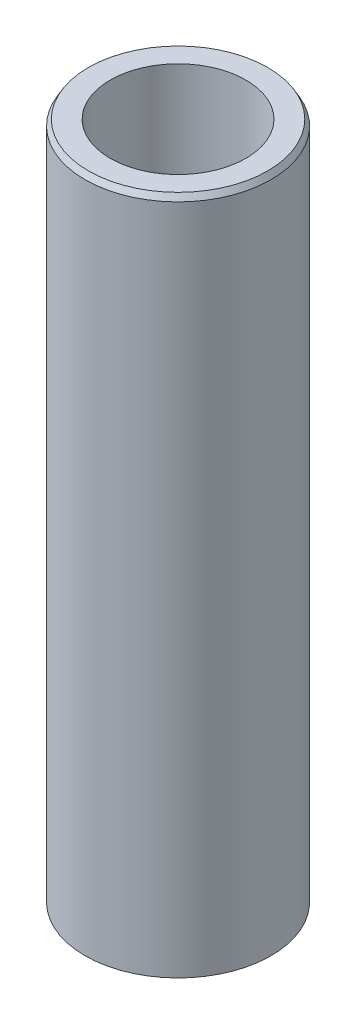
ISO-10303-21;
HEADER;
FILE_DESCRIPTION(('STEP AP214'),'2;1');
FILE_NAME('part.step','',(''),(''),'','','');
FILE_SCHEMA(('AUTOMOTIVE_DESIGN { 1 0 10303 214 1 1 1 1 }'));
ENDSEC;
DATA;
#1=APPLICATION_CONTEXT('core data for automotive mechanical design processes');
#2=APPLICATION_PROTOCOL_DEFINITION('international standard','automotive_design',2000,#1);
#3=PRODUCT_CONTEXT('',#1,'mechanical');
#4=PRODUCT('Part','Part','',(#3));
#5=PRODUCT_RELATED_PRODUCT_CATEGORY('part','',(#4));
#6=PRODUCT_DEFINITION_FORMATION('','',#4);
#7=PRODUCT_DEFINITION_CONTEXT('part definition',#1,'design');
#8=PRODUCT_DEFINITION('design','',#6,#7);
#9=PRODUCT_DEFINITION_SHAPE('','',#8);
#10=(LENGTH_UNIT() NAMED_UNIT(*) SI_UNIT(.MILLI.,.METRE.));
#11=(NAMED_UNIT(*) PLANE_ANGLE_UNIT() SI_UNIT($,.RADIAN.));
#12=(NAMED_UNIT(*) SI_UNIT($,.STERADIAN.) SOLID_ANGLE_UNIT());
#13=UNCERTAINTY_MEASURE_WITH_UNIT(LENGTH_MEASURE(1.E-05),#10,'distance_accuracy_value','');
#14=(GEOMETRIC_REPRESENTATION_CONTEXT(3) GLOBAL_UNCERTAINTY_ASSIGNED_CONTEXT((#13)) GLOBAL_UNIT_ASSIGNED_CONTEXT((#10,
#11,#12)) REPRESENTATION_CONTEXT('',''));
#15=CARTESIAN_POINT('',(0.,0.,0.));
#16=DIRECTION('',(0.,0.,1.));
#17=DIRECTION('',(1.,0.,0.));
#18=AXIS2_PLACEMENT_3D('',#15,#16,#17);
#19=CARTESIAN_POINT('',(0.,91.5575811647103,0.));
#20=DIRECTION('',(0.,-1.,0.));
#21=DIRECTION('',(0.,0.,-1.));
#22=AXIS2_PLACEMENT_3D('',#19,#20,#21);
#23=CYLINDRICAL_SURFACE('',#22,12.5);
#24=CARTESIAN_POINT('',(0.,90.7667106178552,0.));
#25=DIRECTION('',(0.,1.,0.));
#26=DIRECTION('',(0.,0.,1.));
#27=AXIS2_PLACEMENT_3D('',#24,#25,#26);
#28=CIRCLE('',#27,12.5);
#29=CARTESIAN_POINT('',(0.,90.7667106178552,12.5));
#30=VERTEX_POINT('',#29);
#31=EDGE_CURVE('E50',#30,#30,#28,.F.);
#32=ORIENTED_EDGE('',*,*,#31,.T.);
#33=EDGE_LOOP('',(#32));
#34=FACE_BOUND('',#33,.T.);
#35=CARTESIAN_POINT('',(0.,0.456609323120943,0.));
#36=DIRECTION('',(0.,1.,0.));
#37=DIRECTION('',(0.,0.,1.));
#38=AXIS2_PLACEMENT_3D('',#35,#36,#37);
#39=CIRCLE('',#38,12.5);
#40=CARTESIAN_POINT('',(0.,0.456609323120943,12.5));
#41=VERTEX_POINT('',#40);
#42=EDGE_CURVE('E51',#41,#41,#39,.T.);
#43=ORIENTED_EDGE('',*,*,#42,.T.);
#44=EDGE_LOOP('',(#43));
#45=FACE_BOUND('',#44,.T.);
#46=ADVANCED_FACE('F39',(#34,#45),#23,.T.);
#47=CARTESIAN_POINT('',(0.,91.5575811647103,0.));
#48=DIRECTION('',(0.,1.,0.));
#49=DIRECTION('',(0.,0.,1.));
#50=AXIS2_PLACEMENT_3D('',#47,#48,#49);
#51=PLANE('',#50);
#52=CARTESIAN_POINT('',(0.,91.5575811647103,0.));
#53=DIRECTION('',(0.,1.,0.));
#54=DIRECTION('',(0.,0.,1.));
#55=AXIS2_PLACEMENT_3D('',#52,#53,#54);
#56=CIRCLE('',#55,12.0433906768791);
#57=CARTESIAN_POINT('',(0.,91.5575811647103,12.0433906768791));
#58=VERTEX_POINT('',#57);
#59=EDGE_CURVE('E54',#58,#58,#56,.T.);
#60=ORIENTED_EDGE('',*,*,#59,.T.);
#61=EDGE_LOOP('',(#60));
#62=FACE_BOUND('',#61,.T.);
#63=CARTESIAN_POINT('',(0.,91.5575811647103,0.));
#64=DIRECTION('',(0.,1.,0.));
#65=DIRECTION('',(0.,0.,1.));
#66=AXIS2_PLACEMENT_3D('',#63,#64,#65);
#67=CIRCLE('',#66,9.11981826204988);
#68=CARTESIAN_POINT('',(0.,91.5575811647103,9.11981826204988));
#69=VERTEX_POINT('',#68);
#70=EDGE_CURVE('E58',#69,#69,#67,.T.);
#71=ORIENTED_EDGE('',*,*,#70,.F.);
#72=EDGE_LOOP('',(#71));
#73=FACE_BOUND('',#72,.T.);
#74=ADVANCED_FACE('F69',(#62,#73),#51,.T.);
#75=CARTESIAN_POINT('',(0.,0.,0.));
#76=DIRECTION('',(0.,1.,0.));
#77=DIRECTION('',(0.,0.,1.));
#78=AXIS2_PLACEMENT_3D('',#75,#76,#77);
#79=PLANE('',#78);
#80=CARTESIAN_POINT('',(0.,0.,0.));
#81=DIRECTION('',(0.,1.,0.));
#82=DIRECTION('',(0.,0.,1.));
#83=AXIS2_PLACEMENT_3D('',#80,#81,#82);
#84=CIRCLE('',#83,11.7091294531449);
#85=CARTESIAN_POINT('',(0.,0.,11.7091294531449));
#86=VERTEX_POINT('',#85);
#87=EDGE_CURVE('E10',#86,#86,#84,.F.);
#88=ORIENTED_EDGE('',*,*,#87,.T.);
#89=EDGE_LOOP('',(#88));
#90=FACE_BOUND('',#89,.T.);
#91=CARTESIAN_POINT('',(0.,0.,0.));
#92=DIRECTION('',(0.,1.,0.));
#93=DIRECTION('',(0.,0.,1.));
#94=AXIS2_PLACEMENT_3D('',#91,#92,#93);
#95=CIRCLE('',#94,9.11981826204988);
#96=CARTESIAN_POINT('',(0.,0.,9.11981826204988));
#97=VERTEX_POINT('',#96);
#98=EDGE_CURVE('E63',#97,#97,#95,.T.);
#99=ORIENTED_EDGE('',*,*,#98,.T.);
#100=EDGE_LOOP('',(#99));
#101=FACE_BOUND('',#100,.T.);
#102=ADVANCED_FACE('F75',(#90,#101),#79,.F.);
#103=CARTESIAN_POINT('',(0.,91.5575811647103,0.));
#104=DIRECTION('',(0.,-1.,0.));
#105=DIRECTION('',(0.,0.,-1.));
#106=AXIS2_PLACEMENT_3D('',#103,#104,#105);
#107=CYLINDRICAL_SURFACE('',#106,9.11981826204988);
#108=ORIENTED_EDGE('',*,*,#70,.T.);
#109=EDGE_LOOP('',(#108));
#110=FACE_BOUND('',#109,.T.);
#111=ORIENTED_EDGE('',*,*,#98,.F.);
#112=EDGE_LOOP('',(#111));
#113=FACE_BOUND('',#112,.T.);
#114=ADVANCED_FACE('F70',(#110,#113),#107,.F.);
#115=CARTESIAN_POINT('',(0.,91.5575811647103,0.));
#116=DIRECTION('',(0.,-1.,0.));
#117=DIRECTION('',(0.,0.,-1.));
#118=AXIS2_PLACEMENT_3D('',#115,#116,#117);
#119=CONICAL_SURFACE('',#118,12.0433906768791,0.523598775598295);
#120=ORIENTED_EDGE('',*,*,#31,.F.);
#121=EDGE_LOOP('',(#120));
#122=FACE_BOUND('',#121,.T.);
#123=ORIENTED_EDGE('',*,*,#59,.F.);
#124=EDGE_LOOP('',(#123));
#125=FACE_BOUND('',#124,.T.);
#126=ADVANCED_FACE('F81',(#122,#125),#119,.T.);
#127=CARTESIAN_POINT('',(0.,0.456609323120943,0.));
#128=DIRECTION('',(0.,1.,0.));
#129=DIRECTION('',(0.,0.,1.));
#130=AXIS2_PLACEMENT_3D('',#127,#128,#129);
#131=CONICAL_SURFACE('',#130,12.5,1.0471975511966);
#132=ORIENTED_EDGE('',*,*,#87,.F.);
#133=EDGE_LOOP('',(#132));
#134=FACE_BOUND('',#133,.T.);
#135=ORIENTED_EDGE('',*,*,#42,.F.);
#136=EDGE_LOOP('',(#135));
#137=FACE_BOUND('',#136,.T.);
#138=ADVANCED_FACE('F45',(#134,#137),#131,.T.);
#139=CLOSED_SHELL('',(#46,#74,#102,#114,#126,#138));
#140=MANIFOLD_SOLID_BREP('B2',#139);
#141=ADVANCED_BREP_SHAPE_REPRESENTATION('',(#18,#140),#14);
#142=SHAPE_DEFINITION_REPRESENTATION(#9,#141);
ENDSEC;
END-ISO-10303-21;
